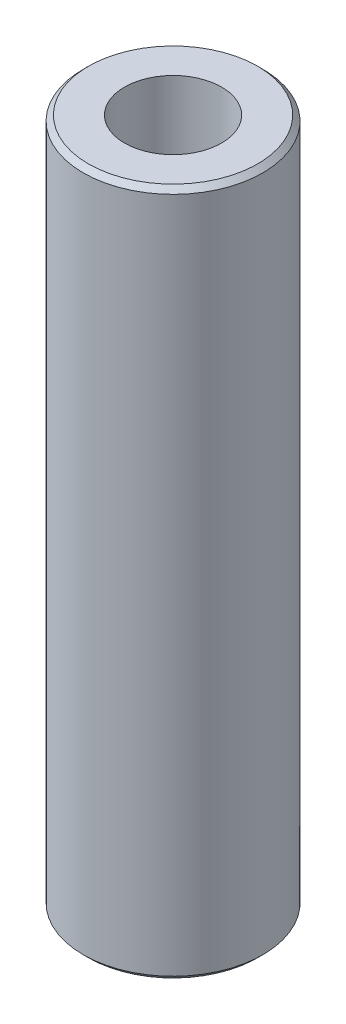
ISO-10303-21;
HEADER;
FILE_DESCRIPTION(('STEP AP214'),'2;1');
FILE_NAME('part.step','',(''),(''),'','','');
FILE_SCHEMA(('AUTOMOTIVE_DESIGN { 1 0 10303 214 1 1 1 1 }'));
ENDSEC;
DATA;
#1=APPLICATION_CONTEXT('core data for automotive mechanical design processes');
#2=APPLICATION_PROTOCOL_DEFINITION('international standard','automotive_design',2000,#1);
#3=PRODUCT_CONTEXT('',#1,'mechanical');
#4=PRODUCT('Part','Part','',(#3));
#5=PRODUCT_RELATED_PRODUCT_CATEGORY('part','',(#4));
#6=PRODUCT_DEFINITION_FORMATION('','',#4);
#7=PRODUCT_DEFINITION_CONTEXT('part definition',#1,'design');
#8=PRODUCT_DEFINITION('design','',#6,#7);
#9=PRODUCT_DEFINITION_SHAPE('','',#8);
#10=(LENGTH_UNIT() NAMED_UNIT(*) SI_UNIT(.MILLI.,.METRE.));
#11=(NAMED_UNIT(*) PLANE_ANGLE_UNIT() SI_UNIT($,.RADIAN.));
#12=(NAMED_UNIT(*) SI_UNIT($,.STERADIAN.) SOLID_ANGLE_UNIT());
#13=UNCERTAINTY_MEASURE_WITH_UNIT(LENGTH_MEASURE(1.E-05),#10,'distance_accuracy_value','');
#14=(GEOMETRIC_REPRESENTATION_CONTEXT(3) GLOBAL_UNCERTAINTY_ASSIGNED_CONTEXT((#13)) GLOBAL_UNIT_ASSIGNED_CONTEXT((#10,
#11,#12)) REPRESENTATION_CONTEXT('',''));
#15=CARTESIAN_POINT('',(0.,0.,0.));
#16=DIRECTION('',(0.,0.,1.));
#17=DIRECTION('',(1.,0.,0.));
#18=AXIS2_PLACEMENT_3D('',#15,#16,#17);
#19=CARTESIAN_POINT('',(0.,287.096144618751,0.));
#20=DIRECTION('',(0.,-1.,0.));
#21=DIRECTION('',(0.,0.,-1.));
#22=AXIS2_PLACEMENT_3D('',#19,#20,#21);
#23=CYLINDRICAL_SURFACE('',#22,37.5);
#24=CARTESIAN_POINT('',(0.,284.930341229507,0.));
#25=DIRECTION('',(0.,1.,0.));
#26=DIRECTION('',(0.,0.,1.));
#27=AXIS2_PLACEMENT_3D('',#24,#25,#26);
#28=CIRCLE('',#27,37.5);
#29=CARTESIAN_POINT('',(0.,284.930341229507,37.5));
#30=VERTEX_POINT('',#29);
#31=EDGE_CURVE('E50',#30,#30,#28,.F.);
#32=ORIENTED_EDGE('',*,*,#31,.T.);
#33=EDGE_LOOP('',(#32));
#34=FACE_BOUND('',#33,.T.);
#35=CARTESIAN_POINT('',(0.,2.16580338924405,0.));
#36=DIRECTION('',(0.,1.,0.));
#37=DIRECTION('',(0.,0.,1.));
#38=AXIS2_PLACEMENT_3D('',#35,#36,#37);
#39=CIRCLE('',#38,37.5);
#40=CARTESIAN_POINT('',(0.,2.16580338924405,37.5));
#41=VERTEX_POINT('',#40);
#42=EDGE_CURVE('E51',#41,#41,#39,.T.);
#43=ORIENTED_EDGE('',*,*,#42,.T.);
#44=EDGE_LOOP('',(#43));
#45=FACE_BOUND('',#44,.T.);
#46=ADVANCED_FACE('F39',(#34,#45),#23,.T.);
#47=CARTESIAN_POINT('',(0.,287.096144618751,0.));
#48=DIRECTION('',(0.,1.,0.));
#49=DIRECTION('',(0.,0.,1.));
#50=AXIS2_PLACEMENT_3D('',#47,#48,#49);
#51=PLANE('',#50);
#52=CARTESIAN_POINT('',(0.,287.096144618751,0.));
#53=DIRECTION('',(0.,1.,0.));
#54=DIRECTION('',(0.,0.,1.));
#55=AXIS2_PLACEMENT_3D('',#52,#53,#54);
#56=CIRCLE('',#55,35.334196610756);
#57=CARTESIAN_POINT('',(0.,287.096144618751,35.334196610756));
#58=VERTEX_POINT('',#57);
#59=EDGE_CURVE('E54',#58,#58,#56,.T.);
#60=ORIENTED_EDGE('',*,*,#59,.T.);
#61=EDGE_LOOP('',(#60));
#62=FACE_BOUND('',#61,.T.);
#63=CARTESIAN_POINT('',(0.,287.096144618751,0.));
#64=DIRECTION('',(0.,1.,0.));
#65=DIRECTION('',(0.,0.,1.));
#66=AXIS2_PLACEMENT_3D('',#63,#64,#65);
#67=CIRCLE('',#66,20.2681197100605);
#68=CARTESIAN_POINT('',(0.,287.096144618751,20.2681197100605));
#69=VERTEX_POINT('',#68);
#70=EDGE_CURVE('E58',#69,#69,#67,.T.);
#71=ORIENTED_EDGE('',*,*,#70,.F.);
#72=EDGE_LOOP('',(#71));
#73=FACE_BOUND('',#72,.T.);
#74=ADVANCED_FACE('F69',(#62,#73),#51,.T.);
#75=CARTESIAN_POINT('',(0.,0.,0.));
#76=DIRECTION('',(0.,1.,0.));
#77=DIRECTION('',(0.,0.,1.));
#78=AXIS2_PLACEMENT_3D('',#75,#76,#77);
#79=PLANE('',#78);
#80=CARTESIAN_POINT('',(0.,0.,0.));
#81=DIRECTION('',(0.,1.,0.));
#82=DIRECTION('',(0.,0.,1.));
#83=AXIS2_PLACEMENT_3D('',#80,#81,#82);
#84=CIRCLE('',#83,35.334196610756);
#85=CARTESIAN_POINT('',(0.,0.,35.334196610756));
#86=VERTEX_POINT('',#85);
#87=EDGE_CURVE('E10',#86,#86,#84,.F.);
#88=ORIENTED_EDGE('',*,*,#87,.T.);
#89=EDGE_LOOP('',(#88));
#90=FACE_BOUND('',#89,.T.);
#91=CARTESIAN_POINT('',(0.,0.,0.));
#92=DIRECTION('',(0.,1.,0.));
#93=DIRECTION('',(0.,0.,1.));
#94=AXIS2_PLACEMENT_3D('',#91,#92,#93);
#95=CIRCLE('',#94,20.2681197100605);
#96=CARTESIAN_POINT('',(0.,0.,20.2681197100605));
#97=VERTEX_POINT('',#96);
#98=EDGE_CURVE('E63',#97,#97,#95,.T.);
#99=ORIENTED_EDGE('',*,*,#98,.T.);
#100=EDGE_LOOP('',(#99));
#101=FACE_BOUND('',#100,.T.);
#102=ADVANCED_FACE('F75',(#90,#101),#79,.F.);
#103=CARTESIAN_POINT('',(0.,287.096144618751,0.));
#104=DIRECTION('',(0.,-1.,0.));
#105=DIRECTION('',(0.,0.,-1.));
#106=AXIS2_PLACEMENT_3D('',#103,#104,#105);
#107=CYLINDRICAL_SURFACE('',#106,20.2681197100605);
#108=ORIENTED_EDGE('',*,*,#70,.T.);
#109=EDGE_LOOP('',(#108));
#110=FACE_BOUND('',#109,.T.);
#111=ORIENTED_EDGE('',*,*,#98,.F.);
#112=EDGE_LOOP('',(#111));
#113=FACE_BOUND('',#112,.T.);
#114=ADVANCED_FACE('F70',(#110,#113),#107,.F.);
#115=CARTESIAN_POINT('',(0.,287.096144618751,0.));
#116=DIRECTION('',(0.,-1.,0.));
#117=DIRECTION('',(0.,0.,-1.));
#118=AXIS2_PLACEMENT_3D('',#115,#116,#117);
#119=CONICAL_SURFACE('',#118,35.334196610756,0.785398163397448);
#120=ORIENTED_EDGE('',*,*,#31,.F.);
#121=EDGE_LOOP('',(#120));
#122=FACE_BOUND('',#121,.T.);
#123=ORIENTED_EDGE('',*,*,#59,.F.);
#124=EDGE_LOOP('',(#123));
#125=FACE_BOUND('',#124,.T.);
#126=ADVANCED_FACE('F81',(#122,#125),#119,.T.);
#127=CARTESIAN_POINT('',(0.,2.16580338924405,0.));
#128=DIRECTION('',(0.,1.,0.));
#129=DIRECTION('',(0.,0.,1.));
#130=AXIS2_PLACEMENT_3D('',#127,#128,#129);
#131=CONICAL_SURFACE('',#130,37.5,0.785398163397448);
#132=ORIENTED_EDGE('',*,*,#87,.F.);
#133=EDGE_LOOP('',(#132));
#134=FACE_BOUND('',#133,.T.);
#135=ORIENTED_EDGE('',*,*,#42,.F.);
#136=EDGE_LOOP('',(#135));
#137=FACE_BOUND('',#136,.T.);
#138=ADVANCED_FACE('F45',(#134,#137),#131,.T.);
#139=CLOSED_SHELL('',(#46,#74,#102,#114,#126,#138));
#140=MANIFOLD_SOLID_BREP('B2',#139);
#141=ADVANCED_BREP_SHAPE_REPRESENTATION('',(#18,#140),#14);
#142=SHAPE_DEFINITION_REPRESENTATION(#9,#141);
ENDSEC;
END-ISO-10303-21;
